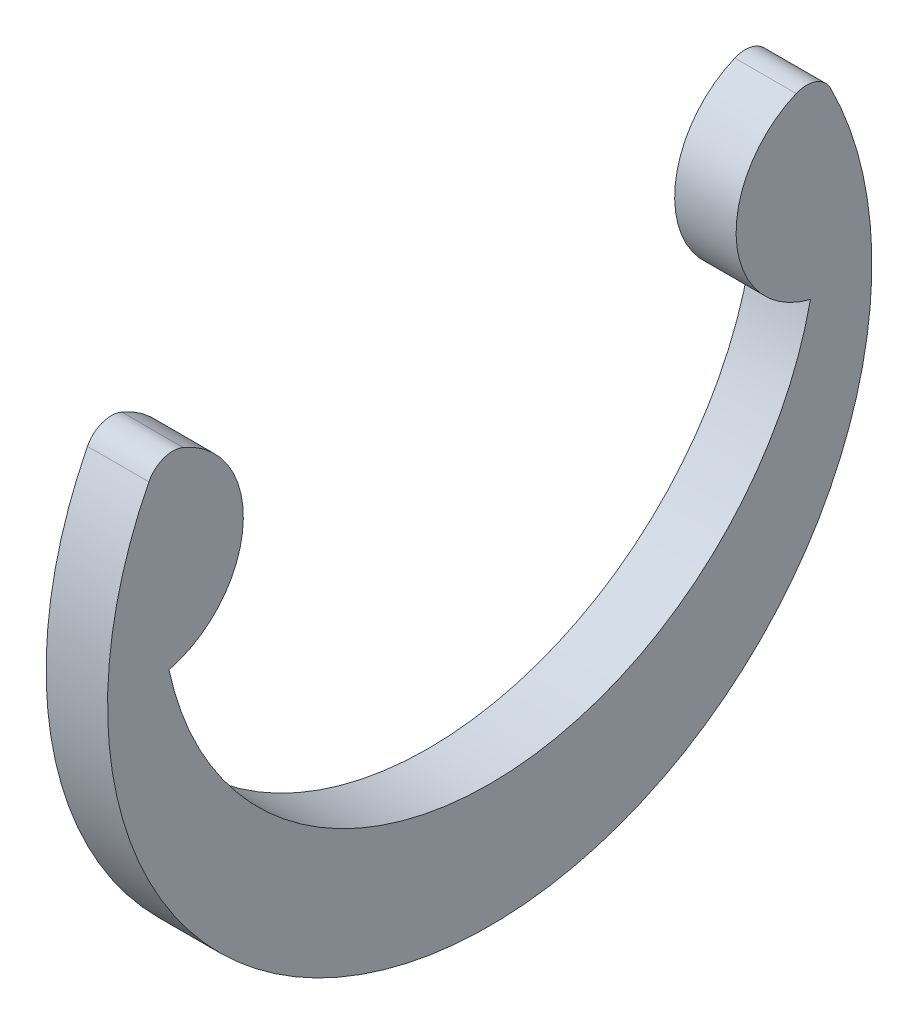
ISO-10303-21;
HEADER;
FILE_DESCRIPTION(('STEP AP214'),'2;1');
FILE_NAME('part.step','',(''),(''),'','','');
FILE_SCHEMA(('AUTOMOTIVE_DESIGN { 1 0 10303 214 1 1 1 1 }'));
ENDSEC;
DATA;
#1=APPLICATION_CONTEXT('core data for automotive mechanical design processes');
#2=APPLICATION_PROTOCOL_DEFINITION('international standard','automotive_design',2000,#1);
#3=PRODUCT_CONTEXT('',#1,'mechanical');
#4=PRODUCT('Part','Part','',(#3));
#5=PRODUCT_RELATED_PRODUCT_CATEGORY('part','',(#4));
#6=PRODUCT_DEFINITION_FORMATION('','',#4);
#7=PRODUCT_DEFINITION_CONTEXT('part definition',#1,'design');
#8=PRODUCT_DEFINITION('design','',#6,#7);
#9=PRODUCT_DEFINITION_SHAPE('','',#8);
#10=(LENGTH_UNIT() NAMED_UNIT(*) SI_UNIT(.MILLI.,.METRE.));
#11=(NAMED_UNIT(*) PLANE_ANGLE_UNIT() SI_UNIT($,.RADIAN.));
#12=(NAMED_UNIT(*) SI_UNIT($,.STERADIAN.) SOLID_ANGLE_UNIT());
#13=UNCERTAINTY_MEASURE_WITH_UNIT(LENGTH_MEASURE(1.E-05),#10,'distance_accuracy_value','');
#14=(GEOMETRIC_REPRESENTATION_CONTEXT(3) GLOBAL_UNCERTAINTY_ASSIGNED_CONTEXT((#13)) GLOBAL_UNIT_ASSIGNED_CONTEXT((#10,
#11,#12)) REPRESENTATION_CONTEXT('',''));
#15=CARTESIAN_POINT('',(0.,0.,0.));
#16=DIRECTION('',(0.,0.,1.));
#17=DIRECTION('',(1.,0.,0.));
#18=AXIS2_PLACEMENT_3D('',#15,#16,#17);
#19=CARTESIAN_POINT('',(-0.3175,0.846512328023186,1.77963484465552));
#20=DIRECTION('',(-1.,0.,0.));
#21=DIRECTION('',(0.,0.,1.));
#22=AXIS2_PLACEMENT_3D('',#19,#20,#21);
#23=PLANE('',#22);
#24=CARTESIAN_POINT('',(-0.3175,0.,0.));
#25=DIRECTION('',(-1.,0.,0.));
#26=DIRECTION('',(0.,0.,1.));
#27=AXIS2_PLACEMENT_3D('',#24,#25,#26);
#28=CIRCLE('',#27,3.9497);
#29=CARTESIAN_POINT('',(-0.3175,1.78646666666667,3.52259377999918));
#30=VERTEX_POINT('',#29);
#31=CARTESIAN_POINT('',(-0.3175,1.78646666666667,-3.52259377999918));
#32=VERTEX_POINT('',#31);
#33=EDGE_CURVE('E92',#30,#32,#28,.F.);
#34=ORIENTED_EDGE('',*,*,#33,.F.);
#35=CARTESIAN_POINT('',(-0.3175,1.66096845654136,3.27513368312914));
#36=DIRECTION('',(-1.,0.,0.));
#37=DIRECTION('',(0.,0.,1.));
#38=AXIS2_PLACEMENT_3D('',#35,#36,#37);
#39=CIRCLE('',#38,0.277464052243861);
#40=CARTESIAN_POINT('',(-0.3175,1.91687954310492,3.16791513967025));
#41=VERTEX_POINT('',#40);
#42=EDGE_CURVE('E82',#41,#30,#39,.F.);
#43=ORIENTED_EDGE('',*,*,#42,.F.);
#44=CARTESIAN_POINT('',(-0.3175,0.982787689221727,3.55926968931105));
#45=DIRECTION('',(-1.,0.,0.));
#46=DIRECTION('',(0.,0.,1.));
#47=AXIS2_PLACEMENT_3D('',#44,#45,#46);
#48=CIRCLE('',#47,1.01276155881603);
#49=CARTESIAN_POINT('',(-0.3175,0.,3.3147));
#50=VERTEX_POINT('',#49);
#51=EDGE_CURVE('E77',#50,#41,#48,.F.);
#52=ORIENTED_EDGE('',*,*,#51,.F.);
#53=CARTESIAN_POINT('',(-0.3175,0.710236966824645,0.));
#54=DIRECTION('',(-1.,0.,0.));
#55=DIRECTION('',(0.,0.,1.));
#56=AXIS2_PLACEMENT_3D('',#53,#54,#55);
#57=CIRCLE('',#56,3.38993696682464);
#58=CARTESIAN_POINT('',(-0.3175,0.,-3.3147));
#59=VERTEX_POINT('',#58);
#60=EDGE_CURVE('E21',#50,#59,#57,.F.);
#61=ORIENTED_EDGE('',*,*,#60,.T.);
#62=CARTESIAN_POINT('',(-0.3175,0.982787689221727,-3.55926968931105));
#63=DIRECTION('',(-1.,0.,0.));
#64=DIRECTION('',(0.,0.,1.));
#65=AXIS2_PLACEMENT_3D('',#62,#63,#64);
#66=CIRCLE('',#65,1.01276155881603);
#67=CARTESIAN_POINT('',(-0.3175,1.91687954310492,-3.16791513967025));
#68=VERTEX_POINT('',#67);
#69=EDGE_CURVE('E97',#68,#59,#66,.F.);
#70=ORIENTED_EDGE('',*,*,#69,.F.);
#71=CARTESIAN_POINT('',(-0.3175,1.66096845654136,-3.27513368312914));
#72=DIRECTION('',(-1.,0.,0.));
#73=DIRECTION('',(0.,0.,1.));
#74=AXIS2_PLACEMENT_3D('',#71,#72,#73);
#75=CIRCLE('',#74,0.277464052243861);
#76=EDGE_CURVE('E95',#32,#68,#75,.F.);
#77=ORIENTED_EDGE('',*,*,#76,.F.);
#78=EDGE_LOOP('',(#34,#43,#52,#61,#70,#77));
#79=FACE_BOUND('',#78,.T.);
#80=ADVANCED_FACE('F18',(#79),#23,.T.);
#81=CARTESIAN_POINT('',(0.3175,0.710236966824645,0.));
#82=DIRECTION('',(-1.,0.,0.));
#83=DIRECTION('',(0.,0.,1.));
#84=AXIS2_PLACEMENT_3D('',#81,#82,#83);
#85=CYLINDRICAL_SURFACE('',#84,3.38993696682464);
#86=DIRECTION('',(-1.,0.,0.));
#87=VECTOR('',#86,1.);
#88=CARTESIAN_POINT('',(0.3175,0.,3.3147));
#89=LINE('',#88,#87);
#90=CARTESIAN_POINT('',(0.3175,0.,3.3147));
#91=VERTEX_POINT('',#90);
#92=EDGE_CURVE('E71',#91,#50,#89,.T.);
#93=ORIENTED_EDGE('',*,*,#92,.F.);
#94=CARTESIAN_POINT('',(0.3175,0.710236966824645,0.));
#95=DIRECTION('',(-1.,0.,0.));
#96=DIRECTION('',(0.,0.,1.));
#97=AXIS2_PLACEMENT_3D('',#94,#95,#96);
#98=CIRCLE('',#97,3.38993696682464);
#99=CARTESIAN_POINT('',(0.3175,0.,-3.3147));
#100=VERTEX_POINT('',#99);
#101=EDGE_CURVE('E79',#91,#100,#98,.F.);
#102=ORIENTED_EDGE('',*,*,#101,.T.);
#103=DIRECTION('',(-1.,0.,0.));
#104=VECTOR('',#103,1.);
#105=CARTESIAN_POINT('',(0.3175,0.,-3.3147));
#106=LINE('',#105,#104);
#107=EDGE_CURVE('E72',#59,#100,#106,.F.);
#108=ORIENTED_EDGE('',*,*,#107,.F.);
#109=ORIENTED_EDGE('',*,*,#60,.F.);
#110=EDGE_LOOP('',(#93,#102,#108,#109));
#111=FACE_BOUND('',#110,.T.);
#112=ADVANCED_FACE('F69',(#111),#85,.F.);
#113=CARTESIAN_POINT('',(0.3175,0.982787689221727,-3.55926968931105));
#114=DIRECTION('',(-1.,0.,0.));
#115=DIRECTION('',(0.,0.,1.));
#116=AXIS2_PLACEMENT_3D('',#113,#114,#115);
#117=CYLINDRICAL_SURFACE('',#116,1.01276155881603);
#118=DIRECTION('',(-1.,0.,0.));
#119=VECTOR('',#118,1.);
#120=CARTESIAN_POINT('',(0.3175,1.91687954310492,-3.16791513967025));
#121=LINE('',#120,#119);
#122=CARTESIAN_POINT('',(0.3175,1.91687954310492,-3.16791513967025));
#123=VERTEX_POINT('',#122);
#124=EDGE_CURVE('E96',#68,#123,#121,.F.);
#125=ORIENTED_EDGE('',*,*,#124,.F.);
#126=ORIENTED_EDGE('',*,*,#69,.T.);
#127=ORIENTED_EDGE('',*,*,#107,.T.);
#128=CARTESIAN_POINT('',(0.3175,0.982787689221727,-3.55926968931105));
#129=DIRECTION('',(-1.,0.,0.));
#130=DIRECTION('',(0.,0.,1.));
#131=AXIS2_PLACEMENT_3D('',#128,#129,#130);
#132=CIRCLE('',#131,1.01276155881603);
#133=EDGE_CURVE('E112',#100,#123,#132,.T.);
#134=ORIENTED_EDGE('',*,*,#133,.T.);
#135=EDGE_LOOP('',(#125,#126,#127,#134));
#136=FACE_BOUND('',#135,.T.);
#137=ADVANCED_FACE('F169',(#136),#117,.T.);
#138=CARTESIAN_POINT('',(0.3175,1.66096845654136,-3.27513368312914));
#139=DIRECTION('',(-1.,0.,0.));
#140=DIRECTION('',(0.,0.,1.));
#141=AXIS2_PLACEMENT_3D('',#138,#139,#140);
#142=CYLINDRICAL_SURFACE('',#141,0.277464052243861);
#143=CARTESIAN_POINT('',(0.3175,1.66096845654136,-3.27513368312914));
#144=DIRECTION('',(-1.,0.,0.));
#145=DIRECTION('',(0.,0.,1.));
#146=AXIS2_PLACEMENT_3D('',#143,#144,#145);
#147=CIRCLE('',#146,0.277464052243861);
#148=CARTESIAN_POINT('',(0.3175,1.78646666666667,-3.52259377999918));
#149=VERTEX_POINT('',#148);
#150=EDGE_CURVE('E110',#123,#149,#147,.T.);
#151=ORIENTED_EDGE('',*,*,#150,.T.);
#152=DIRECTION('',(-1.,0.,0.));
#153=VECTOR('',#152,1.);
#154=CARTESIAN_POINT('',(0.3175,1.78646666666667,-3.52259377999918));
#155=LINE('',#154,#153);
#156=EDGE_CURVE('E94',#32,#149,#155,.F.);
#157=ORIENTED_EDGE('',*,*,#156,.F.);
#158=ORIENTED_EDGE('',*,*,#76,.T.);
#159=ORIENTED_EDGE('',*,*,#124,.T.);
#160=EDGE_LOOP('',(#151,#157,#158,#159));
#161=FACE_BOUND('',#160,.T.);
#162=ADVANCED_FACE('F121',(#161),#142,.T.);
#163=CARTESIAN_POINT('',(0.3175,0.,0.));
#164=DIRECTION('',(-1.,0.,0.));
#165=DIRECTION('',(0.,0.,1.));
#166=AXIS2_PLACEMENT_3D('',#163,#164,#165);
#167=CYLINDRICAL_SURFACE('',#166,3.9497);
#168=DIRECTION('',(-1.,0.,0.));
#169=VECTOR('',#168,1.);
#170=CARTESIAN_POINT('',(0.3175,1.78646666666667,3.52259377999918));
#171=LINE('',#170,#169);
#172=CARTESIAN_POINT('',(0.3175,1.78646666666667,3.52259377999918));
#173=VERTEX_POINT('',#172);
#174=EDGE_CURVE('E83',#30,#173,#171,.F.);
#175=ORIENTED_EDGE('',*,*,#174,.F.);
#176=ORIENTED_EDGE('',*,*,#33,.T.);
#177=ORIENTED_EDGE('',*,*,#156,.T.);
#178=CARTESIAN_POINT('',(0.3175,0.,0.));
#179=DIRECTION('',(-1.,0.,0.));
#180=DIRECTION('',(0.,0.,1.));
#181=AXIS2_PLACEMENT_3D('',#178,#179,#180);
#182=CIRCLE('',#181,3.9497);
#183=EDGE_CURVE('E108',#149,#173,#182,.T.);
#184=ORIENTED_EDGE('',*,*,#183,.T.);
#185=EDGE_LOOP('',(#175,#176,#177,#184));
#186=FACE_BOUND('',#185,.T.);
#187=ADVANCED_FACE('F125',(#186),#167,.T.);
#188=CARTESIAN_POINT('',(0.3175,1.66096845654136,3.27513368312914));
#189=DIRECTION('',(-1.,0.,0.));
#190=DIRECTION('',(0.,0.,1.));
#191=AXIS2_PLACEMENT_3D('',#188,#189,#190);
#192=CYLINDRICAL_SURFACE('',#191,0.277464052243861);
#193=CARTESIAN_POINT('',(0.3175,1.66096845654136,3.27513368312914));
#194=DIRECTION('',(-1.,0.,0.));
#195=DIRECTION('',(0.,0.,1.));
#196=AXIS2_PLACEMENT_3D('',#193,#194,#195);
#197=CIRCLE('',#196,0.277464052243861);
#198=CARTESIAN_POINT('',(0.3175,1.91687954310492,3.16791513967025));
#199=VERTEX_POINT('',#198);
#200=EDGE_CURVE('E27',#173,#199,#197,.T.);
#201=ORIENTED_EDGE('',*,*,#200,.T.);
#202=DIRECTION('',(-1.,0.,0.));
#203=VECTOR('',#202,1.);
#204=CARTESIAN_POINT('',(0.3175,1.91687954310492,3.16791513967025));
#205=LINE('',#204,#203);
#206=EDGE_CURVE('E35',#41,#199,#205,.F.);
#207=ORIENTED_EDGE('',*,*,#206,.F.);
#208=ORIENTED_EDGE('',*,*,#42,.T.);
#209=ORIENTED_EDGE('',*,*,#174,.T.);
#210=EDGE_LOOP('',(#201,#207,#208,#209));
#211=FACE_BOUND('',#210,.T.);
#212=ADVANCED_FACE('F127',(#211),#192,.T.);
#213=CARTESIAN_POINT('',(0.3175,0.982787689221727,3.55926968931105));
#214=DIRECTION('',(-1.,0.,0.));
#215=DIRECTION('',(0.,0.,1.));
#216=AXIS2_PLACEMENT_3D('',#213,#214,#215);
#217=CYLINDRICAL_SURFACE('',#216,1.01276155881603);
#218=CARTESIAN_POINT('',(0.3175,0.982787689221727,3.55926968931105));
#219=DIRECTION('',(-1.,0.,0.));
#220=DIRECTION('',(0.,0.,1.));
#221=AXIS2_PLACEMENT_3D('',#218,#219,#220);
#222=CIRCLE('',#221,1.01276155881603);
#223=EDGE_CURVE('E11',#199,#91,#222,.T.);
#224=ORIENTED_EDGE('',*,*,#223,.T.);
#225=ORIENTED_EDGE('',*,*,#92,.T.);
#226=ORIENTED_EDGE('',*,*,#51,.T.);
#227=ORIENTED_EDGE('',*,*,#206,.T.);
#228=EDGE_LOOP('',(#224,#225,#226,#227));
#229=FACE_BOUND('',#228,.T.);
#230=ADVANCED_FACE('F76',(#229),#217,.T.);
#231=CARTESIAN_POINT('',(0.3175,0.846512328023186,1.77963484465552));
#232=DIRECTION('',(-1.,0.,0.));
#233=DIRECTION('',(0.,0.,1.));
#234=AXIS2_PLACEMENT_3D('',#231,#232,#233);
#235=PLANE('',#234);
#236=ORIENTED_EDGE('',*,*,#200,.F.);
#237=ORIENTED_EDGE('',*,*,#183,.F.);
#238=ORIENTED_EDGE('',*,*,#150,.F.);
#239=ORIENTED_EDGE('',*,*,#133,.F.);
#240=ORIENTED_EDGE('',*,*,#101,.F.);
#241=ORIENTED_EDGE('',*,*,#223,.F.);
#242=EDGE_LOOP('',(#236,#237,#238,#239,#240,#241));
#243=FACE_BOUND('',#242,.T.);
#244=ADVANCED_FACE('F116',(#243),#235,.F.);
#245=CLOSED_SHELL('',(#80,#112,#137,#162,#187,#212,#230,#244));
#246=MANIFOLD_SOLID_BREP('B1',#245);
#247=ADVANCED_BREP_SHAPE_REPRESENTATION('',(#18,#246),#14);
#248=SHAPE_DEFINITION_REPRESENTATION(#9,#247);
ENDSEC;
END-ISO-10303-21;
